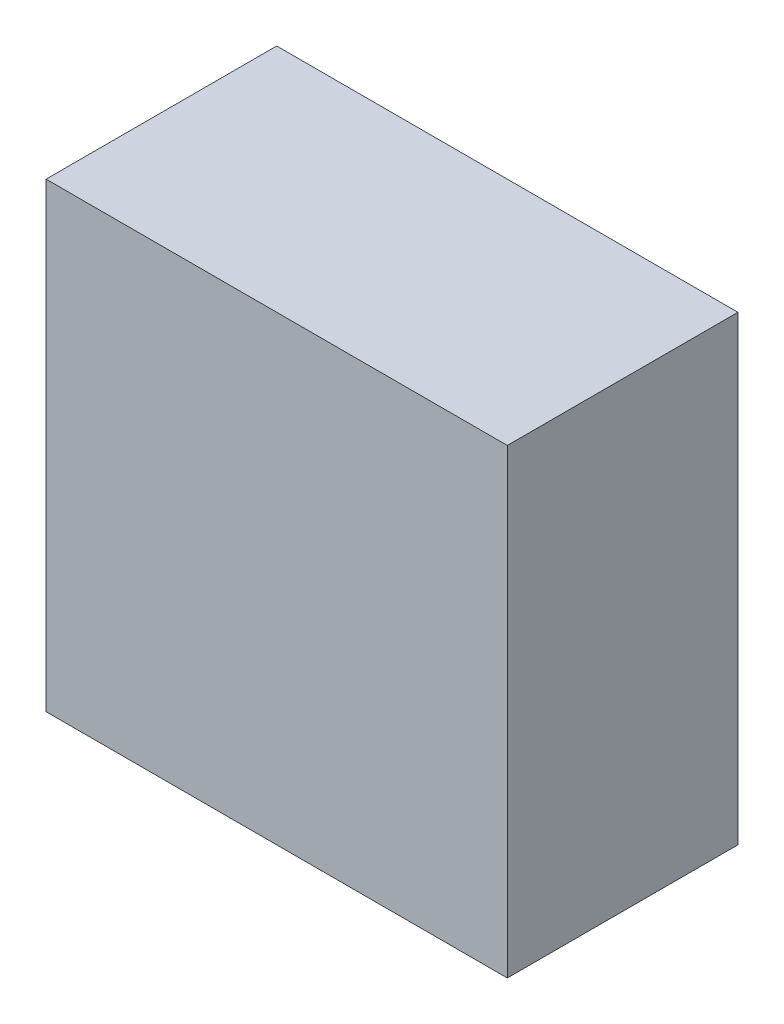
ISO-10303-21;
HEADER;
FILE_DESCRIPTION(('STEP AP214'),'2;1');
FILE_NAME('part.step','',(''),(''),'','','');
FILE_SCHEMA(('AUTOMOTIVE_DESIGN { 1 0 10303 214 1 1 1 1 }'));
ENDSEC;
DATA;
#1=APPLICATION_CONTEXT('core data for automotive mechanical design processes');
#2=APPLICATION_PROTOCOL_DEFINITION('international standard','automotive_design',2000,#1);
#3=PRODUCT_CONTEXT('',#1,'mechanical');
#4=PRODUCT('Part','Part','',(#3));
#5=PRODUCT_RELATED_PRODUCT_CATEGORY('part','',(#4));
#6=PRODUCT_DEFINITION_FORMATION('','',#4);
#7=PRODUCT_DEFINITION_CONTEXT('part definition',#1,'design');
#8=PRODUCT_DEFINITION('design','',#6,#7);
#9=PRODUCT_DEFINITION_SHAPE('','',#8);
#10=(LENGTH_UNIT() NAMED_UNIT(*) SI_UNIT(.MILLI.,.METRE.));
#11=(NAMED_UNIT(*) PLANE_ANGLE_UNIT() SI_UNIT($,.RADIAN.));
#12=(NAMED_UNIT(*) SI_UNIT($,.STERADIAN.) SOLID_ANGLE_UNIT());
#13=UNCERTAINTY_MEASURE_WITH_UNIT(LENGTH_MEASURE(1.E-05),#10,'distance_accuracy_value','');
#14=(GEOMETRIC_REPRESENTATION_CONTEXT(3) GLOBAL_UNCERTAINTY_ASSIGNED_CONTEXT((#13)) GLOBAL_UNIT_ASSIGNED_CONTEXT((#10,
#11,#12)) REPRESENTATION_CONTEXT('',''));
#15=CARTESIAN_POINT('',(0.,0.,0.));
#16=DIRECTION('',(0.,0.,1.));
#17=DIRECTION('',(1.,0.,0.));
#18=AXIS2_PLACEMENT_3D('',#15,#16,#17);
#19=CARTESIAN_POINT('',(-30.,60.,-15.));
#20=DIRECTION('',(1.,0.,0.));
#21=DIRECTION('',(0.,0.,-1.));
#22=AXIS2_PLACEMENT_3D('',#19,#20,#21);
#23=PLANE('',#22);
#24=DIRECTION('',(0.,0.,1.));
#25=VECTOR('',#24,1.);
#26=CARTESIAN_POINT('',(-30.,0.,-15.));
#27=LINE('',#26,#25);
#28=CARTESIAN_POINT('',(-30.,0.,-15.));
#29=VERTEX_POINT('',#28);
#30=CARTESIAN_POINT('',(-30.,0.,15.));
#31=VERTEX_POINT('',#30);
#32=EDGE_CURVE('E96',#29,#31,#27,.T.);
#33=ORIENTED_EDGE('',*,*,#32,.T.);
#34=DIRECTION('',(0.,-1.,0.));
#35=VECTOR('',#34,1.);
#36=CARTESIAN_POINT('',(-30.,60.,15.));
#37=LINE('',#36,#35);
#38=CARTESIAN_POINT('',(-30.,60.,15.));
#39=VERTEX_POINT('',#38);
#40=EDGE_CURVE('E11',#39,#31,#37,.T.);
#41=ORIENTED_EDGE('',*,*,#40,.F.);
#42=DIRECTION('',(0.,0.,1.));
#43=VECTOR('',#42,1.);
#44=CARTESIAN_POINT('',(-30.,60.,-15.));
#45=LINE('',#44,#43);
#46=CARTESIAN_POINT('',(-30.,60.,-15.));
#47=VERTEX_POINT('',#46);
#48=EDGE_CURVE('E82',#47,#39,#45,.T.);
#49=ORIENTED_EDGE('',*,*,#48,.F.);
#50=DIRECTION('',(0.,-1.,0.));
#51=VECTOR('',#50,1.);
#52=CARTESIAN_POINT('',(-30.,60.,-15.));
#53=LINE('',#52,#51);
#54=EDGE_CURVE('E49',#47,#29,#53,.T.);
#55=ORIENTED_EDGE('',*,*,#54,.T.);
#56=EDGE_LOOP('',(#33,#41,#49,#55));
#57=FACE_BOUND('',#56,.T.);
#58=ADVANCED_FACE('F33',(#57),#23,.F.);
#59=CARTESIAN_POINT('',(-30.,60.,15.));
#60=DIRECTION('',(0.,0.,-1.));
#61=DIRECTION('',(-1.,0.,0.));
#62=AXIS2_PLACEMENT_3D('',#59,#60,#61);
#63=PLANE('',#62);
#64=DIRECTION('',(1.,0.,0.));
#65=VECTOR('',#64,1.);
#66=CARTESIAN_POINT('',(-30.,0.,15.));
#67=LINE('',#66,#65);
#68=CARTESIAN_POINT('',(30.,0.,15.));
#69=VERTEX_POINT('',#68);
#70=EDGE_CURVE('E87',#31,#69,#67,.T.);
#71=ORIENTED_EDGE('',*,*,#70,.T.);
#72=DIRECTION('',(0.,-1.,0.));
#73=VECTOR('',#72,1.);
#74=CARTESIAN_POINT('',(30.,60.,15.));
#75=LINE('',#74,#73);
#76=CARTESIAN_POINT('',(30.,60.,15.));
#77=VERTEX_POINT('',#76);
#78=EDGE_CURVE('E41',#77,#69,#75,.T.);
#79=ORIENTED_EDGE('',*,*,#78,.F.);
#80=DIRECTION('',(1.,0.,0.));
#81=VECTOR('',#80,1.);
#82=CARTESIAN_POINT('',(-30.,60.,15.));
#83=LINE('',#82,#81);
#84=EDGE_CURVE('E74',#39,#77,#83,.T.);
#85=ORIENTED_EDGE('',*,*,#84,.F.);
#86=ORIENTED_EDGE('',*,*,#40,.T.);
#87=EDGE_LOOP('',(#71,#79,#85,#86));
#88=FACE_BOUND('',#87,.T.);
#89=ADVANCED_FACE('F86',(#88),#63,.F.);
#90=CARTESIAN_POINT('',(30.,60.,-15.));
#91=DIRECTION('',(1.,0.,0.));
#92=DIRECTION('',(0.,0.,-1.));
#93=AXIS2_PLACEMENT_3D('',#90,#91,#92);
#94=PLANE('',#93);
#95=DIRECTION('',(0.,0.,1.));
#96=VECTOR('',#95,1.);
#97=CARTESIAN_POINT('',(30.,0.,-15.));
#98=LINE('',#97,#96);
#99=CARTESIAN_POINT('',(30.,0.,-15.));
#100=VERTEX_POINT('',#99);
#101=EDGE_CURVE('E99',#100,#69,#98,.T.);
#102=ORIENTED_EDGE('',*,*,#101,.F.);
#103=DIRECTION('',(0.,-1.,0.));
#104=VECTOR('',#103,1.);
#105=CARTESIAN_POINT('',(30.,60.,-15.));
#106=LINE('',#105,#104);
#107=CARTESIAN_POINT('',(30.,60.,-15.));
#108=VERTEX_POINT('',#107);
#109=EDGE_CURVE('E63',#108,#100,#106,.T.);
#110=ORIENTED_EDGE('',*,*,#109,.F.);
#111=DIRECTION('',(0.,0.,1.));
#112=VECTOR('',#111,1.);
#113=CARTESIAN_POINT('',(30.,60.,-15.));
#114=LINE('',#113,#112);
#115=EDGE_CURVE('E81',#108,#77,#114,.T.);
#116=ORIENTED_EDGE('',*,*,#115,.T.);
#117=ORIENTED_EDGE('',*,*,#78,.T.);
#118=EDGE_LOOP('',(#102,#110,#116,#117));
#119=FACE_BOUND('',#118,.T.);
#120=ADVANCED_FACE('F90',(#119),#94,.T.);
#121=CARTESIAN_POINT('',(-30.,60.,-15.));
#122=DIRECTION('',(0.,0.,-1.));
#123=DIRECTION('',(-1.,0.,0.));
#124=AXIS2_PLACEMENT_3D('',#121,#122,#123);
#125=PLANE('',#124);
#126=DIRECTION('',(1.,0.,0.));
#127=VECTOR('',#126,1.);
#128=CARTESIAN_POINT('',(-30.,0.,-15.));
#129=LINE('',#128,#127);
#130=EDGE_CURVE('E101',#29,#100,#129,.T.);
#131=ORIENTED_EDGE('',*,*,#130,.F.);
#132=ORIENTED_EDGE('',*,*,#54,.F.);
#133=DIRECTION('',(1.,0.,0.));
#134=VECTOR('',#133,1.);
#135=CARTESIAN_POINT('',(-30.,60.,-15.));
#136=LINE('',#135,#134);
#137=EDGE_CURVE('E91',#47,#108,#136,.T.);
#138=ORIENTED_EDGE('',*,*,#137,.T.);
#139=ORIENTED_EDGE('',*,*,#109,.T.);
#140=EDGE_LOOP('',(#131,#132,#138,#139));
#141=FACE_BOUND('',#140,.T.);
#142=ADVANCED_FACE('F107',(#141),#125,.T.);
#143=CARTESIAN_POINT('',(0.,60.,0.));
#144=DIRECTION('',(0.,1.,0.));
#145=DIRECTION('',(0.,0.,1.));
#146=AXIS2_PLACEMENT_3D('',#143,#144,#145);
#147=PLANE('',#146);
#148=ORIENTED_EDGE('',*,*,#48,.T.);
#149=ORIENTED_EDGE('',*,*,#84,.T.);
#150=ORIENTED_EDGE('',*,*,#115,.F.);
#151=ORIENTED_EDGE('',*,*,#137,.F.);
#152=EDGE_LOOP('',(#148,#149,#150,#151));
#153=FACE_BOUND('',#152,.T.);
#154=ADVANCED_FACE('F78',(#153),#147,.T.);
#155=CARTESIAN_POINT('',(0.,0.,0.));
#156=DIRECTION('',(0.,1.,0.));
#157=DIRECTION('',(0.,0.,1.));
#158=AXIS2_PLACEMENT_3D('',#155,#156,#157);
#159=PLANE('',#158);
#160=ORIENTED_EDGE('',*,*,#32,.F.);
#161=ORIENTED_EDGE('',*,*,#130,.T.);
#162=ORIENTED_EDGE('',*,*,#101,.T.);
#163=ORIENTED_EDGE('',*,*,#70,.F.);
#164=EDGE_LOOP('',(#160,#161,#162,#163));
#165=FACE_BOUND('',#164,.T.);
#166=ADVANCED_FACE('F106',(#165),#159,.F.);
#167=CLOSED_SHELL('',(#58,#89,#120,#142,#154,#166));
#168=MANIFOLD_SOLID_BREP('B2',#167);
#169=ADVANCED_BREP_SHAPE_REPRESENTATION('',(#18,#168),#14);
#170=SHAPE_DEFINITION_REPRESENTATION(#9,#169);
ENDSEC;
END-ISO-10303-21;
